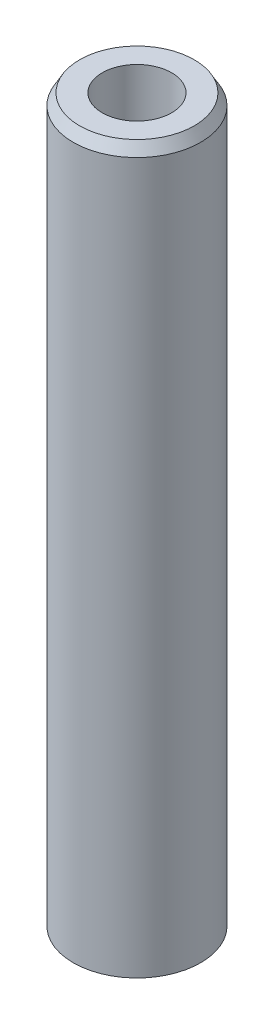
ISO-10303-21;
HEADER;
FILE_DESCRIPTION(('STEP AP214'),'2;1');
FILE_NAME('part.step','',(''),(''),'','','');
FILE_SCHEMA(('AUTOMOTIVE_DESIGN { 1 0 10303 214 1 1 1 1 }'));
ENDSEC;
DATA;
#1=APPLICATION_CONTEXT('core data for automotive mechanical design processes');
#2=APPLICATION_PROTOCOL_DEFINITION('international standard','automotive_design',2000,#1);
#3=PRODUCT_CONTEXT('',#1,'mechanical');
#4=PRODUCT('Part','Part','',(#3));
#5=PRODUCT_RELATED_PRODUCT_CATEGORY('part','',(#4));
#6=PRODUCT_DEFINITION_FORMATION('','',#4);
#7=PRODUCT_DEFINITION_CONTEXT('part definition',#1,'design');
#8=PRODUCT_DEFINITION('design','',#6,#7);
#9=PRODUCT_DEFINITION_SHAPE('','',#8);
#10=(LENGTH_UNIT() NAMED_UNIT(*) SI_UNIT(.MILLI.,.METRE.));
#11=(NAMED_UNIT(*) PLANE_ANGLE_UNIT() SI_UNIT($,.RADIAN.));
#12=(NAMED_UNIT(*) SI_UNIT($,.STERADIAN.) SOLID_ANGLE_UNIT());
#13=UNCERTAINTY_MEASURE_WITH_UNIT(LENGTH_MEASURE(1.E-05),#10,'distance_accuracy_value','');
#14=(GEOMETRIC_REPRESENTATION_CONTEXT(3) GLOBAL_UNCERTAINTY_ASSIGNED_CONTEXT((#13)) GLOBAL_UNIT_ASSIGNED_CONTEXT((#10,
#11,#12)) REPRESENTATION_CONTEXT('',''));
#15=CARTESIAN_POINT('',(0.,0.,0.));
#16=DIRECTION('',(0.,0.,1.));
#17=DIRECTION('',(1.,0.,0.));
#18=AXIS2_PLACEMENT_3D('',#15,#16,#17);
#19=CARTESIAN_POINT('',(0.,114.282805811629,0.));
#20=DIRECTION('',(0.,-1.,0.));
#21=DIRECTION('',(0.,0.,-1.));
#22=AXIS2_PLACEMENT_3D('',#19,#20,#21);
#23=CYLINDRICAL_SURFACE('',#22,10.);
#24=CARTESIAN_POINT('',(0.,112.540436047593,0.));
#25=DIRECTION('',(0.,1.,0.));
#26=DIRECTION('',(0.,0.,1.));
#27=AXIS2_PLACEMENT_3D('',#24,#25,#26);
#28=CIRCLE('',#27,10.);
#29=CARTESIAN_POINT('',(0.,112.540436047593,10.));
#30=VERTEX_POINT('',#29);
#31=EDGE_CURVE('E50',#30,#30,#28,.F.);
#32=ORIENTED_EDGE('',*,*,#31,.T.);
#33=EDGE_LOOP('',(#32));
#34=FACE_BOUND('',#33,.T.);
#35=CARTESIAN_POINT('',(0.,1.0059576522941,0.));
#36=DIRECTION('',(0.,1.,0.));
#37=DIRECTION('',(0.,0.,1.));
#38=AXIS2_PLACEMENT_3D('',#35,#36,#37);
#39=CIRCLE('',#38,10.);
#40=CARTESIAN_POINT('',(0.,1.0059576522941,10.));
#41=VERTEX_POINT('',#40);
#42=EDGE_CURVE('E51',#41,#41,#39,.T.);
#43=ORIENTED_EDGE('',*,*,#42,.T.);
#44=EDGE_LOOP('',(#43));
#45=FACE_BOUND('',#44,.T.);
#46=ADVANCED_FACE('F39',(#34,#45),#23,.T.);
#47=CARTESIAN_POINT('',(0.,114.282805811629,0.));
#48=DIRECTION('',(0.,1.,0.));
#49=DIRECTION('',(0.,0.,1.));
#50=AXIS2_PLACEMENT_3D('',#47,#48,#49);
#51=PLANE('',#50);
#52=CARTESIAN_POINT('',(0.,114.282805811629,0.));
#53=DIRECTION('',(0.,1.,0.));
#54=DIRECTION('',(0.,0.,1.));
#55=AXIS2_PLACEMENT_3D('',#52,#53,#54);
#56=CIRCLE('',#55,8.99404234770591);
#57=CARTESIAN_POINT('',(0.,114.282805811629,8.99404234770591));
#58=VERTEX_POINT('',#57);
#59=EDGE_CURVE('E54',#58,#58,#56,.T.);
#60=ORIENTED_EDGE('',*,*,#59,.T.);
#61=EDGE_LOOP('',(#60));
#62=FACE_BOUND('',#61,.T.);
#63=CARTESIAN_POINT('',(0.,114.282805811629,0.));
#64=DIRECTION('',(0.,1.,0.));
#65=DIRECTION('',(0.,0.,1.));
#66=AXIS2_PLACEMENT_3D('',#63,#64,#65);
#67=CIRCLE('',#66,5.44993882741411);
#68=CARTESIAN_POINT('',(0.,114.282805811629,5.44993882741411));
#69=VERTEX_POINT('',#68);
#70=EDGE_CURVE('E58',#69,#69,#67,.T.);
#71=ORIENTED_EDGE('',*,*,#70,.F.);
#72=EDGE_LOOP('',(#71));
#73=FACE_BOUND('',#72,.T.);
#74=ADVANCED_FACE('F69',(#62,#73),#51,.T.);
#75=CARTESIAN_POINT('',(0.,0.,0.));
#76=DIRECTION('',(0.,1.,0.));
#77=DIRECTION('',(0.,0.,1.));
#78=AXIS2_PLACEMENT_3D('',#75,#76,#77);
#79=PLANE('',#78);
#80=CARTESIAN_POINT('',(0.,0.,0.));
#81=DIRECTION('',(0.,1.,0.));
#82=DIRECTION('',(0.,0.,1.));
#83=AXIS2_PLACEMENT_3D('',#80,#81,#82);
#84=CIRCLE('',#83,8.25763023596392);
#85=CARTESIAN_POINT('',(0.,0.,8.25763023596392));
#86=VERTEX_POINT('',#85);
#87=EDGE_CURVE('E10',#86,#86,#84,.F.);
#88=ORIENTED_EDGE('',*,*,#87,.T.);
#89=EDGE_LOOP('',(#88));
#90=FACE_BOUND('',#89,.T.);
#91=CARTESIAN_POINT('',(0.,0.,0.));
#92=DIRECTION('',(0.,1.,0.));
#93=DIRECTION('',(0.,0.,1.));
#94=AXIS2_PLACEMENT_3D('',#91,#92,#93);
#95=CIRCLE('',#94,5.44993882741411);
#96=CARTESIAN_POINT('',(0.,0.,5.44993882741411));
#97=VERTEX_POINT('',#96);
#98=EDGE_CURVE('E63',#97,#97,#95,.T.);
#99=ORIENTED_EDGE('',*,*,#98,.T.);
#100=EDGE_LOOP('',(#99));
#101=FACE_BOUND('',#100,.T.);
#102=ADVANCED_FACE('F75',(#90,#101),#79,.F.);
#103=CARTESIAN_POINT('',(0.,114.282805811629,0.));
#104=DIRECTION('',(0.,-1.,0.));
#105=DIRECTION('',(0.,0.,-1.));
#106=AXIS2_PLACEMENT_3D('',#103,#104,#105);
#107=CYLINDRICAL_SURFACE('',#106,5.44993882741411);
#108=ORIENTED_EDGE('',*,*,#70,.T.);
#109=EDGE_LOOP('',(#108));
#110=FACE_BOUND('',#109,.T.);
#111=ORIENTED_EDGE('',*,*,#98,.F.);
#112=EDGE_LOOP('',(#111));
#113=FACE_BOUND('',#112,.T.);
#114=ADVANCED_FACE('F70',(#110,#113),#107,.F.);
#115=CARTESIAN_POINT('',(0.,114.282805811629,0.));
#116=DIRECTION('',(0.,-1.,0.));
#117=DIRECTION('',(0.,0.,-1.));
#118=AXIS2_PLACEMENT_3D('',#115,#116,#117);
#119=CONICAL_SURFACE('',#118,8.99404234770591,0.523598775598292);
#120=ORIENTED_EDGE('',*,*,#31,.F.);
#121=EDGE_LOOP('',(#120));
#122=FACE_BOUND('',#121,.T.);
#123=ORIENTED_EDGE('',*,*,#59,.F.);
#124=EDGE_LOOP('',(#123));
#125=FACE_BOUND('',#124,.T.);
#126=ADVANCED_FACE('F81',(#122,#125),#119,.T.);
#127=CARTESIAN_POINT('',(0.,1.0059576522941,0.));
#128=DIRECTION('',(0.,1.,0.));
#129=DIRECTION('',(0.,0.,1.));
#130=AXIS2_PLACEMENT_3D('',#127,#128,#129);
#131=CONICAL_SURFACE('',#130,10.,1.0471975511966);
#132=ORIENTED_EDGE('',*,*,#87,.F.);
#133=EDGE_LOOP('',(#132));
#134=FACE_BOUND('',#133,.T.);
#135=ORIENTED_EDGE('',*,*,#42,.F.);
#136=EDGE_LOOP('',(#135));
#137=FACE_BOUND('',#136,.T.);
#138=ADVANCED_FACE('F45',(#134,#137),#131,.T.);
#139=CLOSED_SHELL('',(#46,#74,#102,#114,#126,#138));
#140=MANIFOLD_SOLID_BREP('B2',#139);
#141=ADVANCED_BREP_SHAPE_REPRESENTATION('',(#18,#140),#14);
#142=SHAPE_DEFINITION_REPRESENTATION(#9,#141);
ENDSEC;
END-ISO-10303-21;
